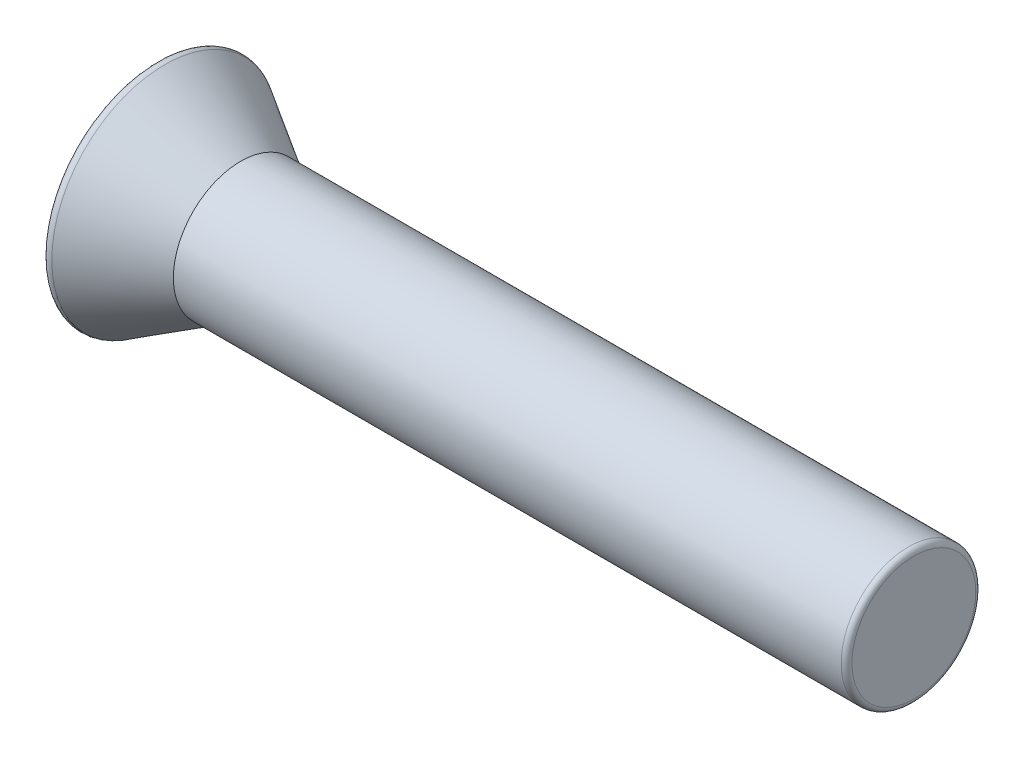
ISO-10303-21;
HEADER;
FILE_DESCRIPTION(('STEP AP214'),'2;1');
FILE_NAME('part.step','',(''),(''),'','','');
FILE_SCHEMA(('AUTOMOTIVE_DESIGN { 1 0 10303 214 1 1 1 1 }'));
ENDSEC;
DATA;
#1=APPLICATION_CONTEXT('core data for automotive mechanical design processes');
#2=APPLICATION_PROTOCOL_DEFINITION('international standard','automotive_design',2000,#1);
#3=PRODUCT_CONTEXT('',#1,'mechanical');
#4=PRODUCT('Part','Part','',(#3));
#5=PRODUCT_RELATED_PRODUCT_CATEGORY('part','',(#4));
#6=PRODUCT_DEFINITION_FORMATION('','',#4);
#7=PRODUCT_DEFINITION_CONTEXT('part definition',#1,'design');
#8=PRODUCT_DEFINITION('design','',#6,#7);
#9=PRODUCT_DEFINITION_SHAPE('','',#8);
#10=(LENGTH_UNIT() NAMED_UNIT(*) SI_UNIT(.MILLI.,.METRE.));
#11=(NAMED_UNIT(*) PLANE_ANGLE_UNIT() SI_UNIT($,.RADIAN.));
#12=(NAMED_UNIT(*) SI_UNIT($,.STERADIAN.) SOLID_ANGLE_UNIT());
#13=UNCERTAINTY_MEASURE_WITH_UNIT(LENGTH_MEASURE(1.E-05),#10,'distance_accuracy_value','');
#14=(GEOMETRIC_REPRESENTATION_CONTEXT(3) GLOBAL_UNCERTAINTY_ASSIGNED_CONTEXT((#13)) GLOBAL_UNIT_ASSIGNED_CONTEXT((#10,
#11,#12)) REPRESENTATION_CONTEXT('',''));
#15=CARTESIAN_POINT('',(0.,0.,0.));
#16=DIRECTION('',(0.,0.,1.));
#17=DIRECTION('',(1.,0.,0.));
#18=AXIS2_PLACEMENT_3D('',#15,#16,#17);
#19=CARTESIAN_POINT('',(2.5,0.,0.));
#20=DIRECTION('',(-1.,0.,0.));
#21=DIRECTION('',(0.,0.,1.));
#22=AXIS2_PLACEMENT_3D('',#19,#20,#21);
#23=CONICAL_SURFACE('',#22,2.,0.540419500270584);
#24=CARTESIAN_POINT('',(0.242319320868404,0.,0.));
#25=DIRECTION('',(1.,0.,0.));
#26=DIRECTION('',(0.,0.,-1.));
#27=AXIS2_PLACEMENT_3D('',#24,#25,#26);
#28=CIRCLE('',#27,3.35460840747896);
#29=CARTESIAN_POINT('',(0.242319320868404,0.,-3.35460840747896));
#30=VERTEX_POINT('',#29);
#31=EDGE_CURVE('E251',#30,#30,#28,.T.);
#32=ORIENTED_EDGE('',*,*,#31,.T.);
#33=EDGE_LOOP('',(#32));
#34=FACE_BOUND('',#33,.T.);
#35=CARTESIAN_POINT('',(2.5,0.,0.));
#36=DIRECTION('',(1.,0.,0.));
#37=DIRECTION('',(0.,0.,-1.));
#38=AXIS2_PLACEMENT_3D('',#35,#36,#37);
#39=CIRCLE('',#38,2.);
#40=CARTESIAN_POINT('',(2.5,0.,-2.));
#41=VERTEX_POINT('',#40);
#42=EDGE_CURVE('E220',#41,#41,#39,.T.);
#43=ORIENTED_EDGE('',*,*,#42,.F.);
#44=EDGE_LOOP('',(#43));
#45=FACE_BOUND('',#44,.T.);
#46=ADVANCED_FACE('F45',(#34,#45),#23,.T.);
#47=CARTESIAN_POINT('',(0.,0.,0.));
#48=DIRECTION('',(-1.,0.,0.));
#49=DIRECTION('',(0.,0.,1.));
#50=AXIS2_PLACEMENT_3D('',#47,#48,#49);
#51=PLANE('',#50);
#52=DIRECTION('',(0.,0.,1.));
#53=VECTOR('',#52,1.);
#54=CARTESIAN_POINT('',(0.,-2.15,-0.41));
#55=LINE('',#54,#53);
#56=CARTESIAN_POINT('',(0.,-2.15,-0.41));
#57=VERTEX_POINT('',#56);
#58=CARTESIAN_POINT('',(0.,-2.15,0.41));
#59=VERTEX_POINT('',#58);
#60=EDGE_CURVE('E61',#57,#59,#55,.T.);
#61=ORIENTED_EDGE('',*,*,#60,.F.);
#62=DIRECTION('',(0.,-1.,0.));
#63=VECTOR('',#62,1.);
#64=CARTESIAN_POINT('',(0.,-0.41,-0.41));
#65=LINE('',#64,#63);
#66=CARTESIAN_POINT('',(0.,-0.41,-0.41));
#67=VERTEX_POINT('',#66);
#68=EDGE_CURVE('E214',#67,#57,#65,.T.);
#69=ORIENTED_EDGE('',*,*,#68,.F.);
#70=DIRECTION('',(0.,0.,1.));
#71=VECTOR('',#70,1.);
#72=CARTESIAN_POINT('',(0.,-0.410000000000001,-2.15));
#73=LINE('',#72,#71);
#74=CARTESIAN_POINT('',(0.,-0.410000000000001,-2.15));
#75=VERTEX_POINT('',#74);
#76=EDGE_CURVE('E211',#75,#67,#73,.T.);
#77=ORIENTED_EDGE('',*,*,#76,.F.);
#78=DIRECTION('',(0.,-1.,0.));
#79=VECTOR('',#78,1.);
#80=CARTESIAN_POINT('',(0.,0.409999999999999,-2.15));
#81=LINE('',#80,#79);
#82=CARTESIAN_POINT('',(0.,0.409999999999999,-2.15));
#83=VERTEX_POINT('',#82);
#84=EDGE_CURVE('E145',#83,#75,#81,.T.);
#85=ORIENTED_EDGE('',*,*,#84,.F.);
#86=DIRECTION('',(0.,0.,-1.));
#87=VECTOR('',#86,1.);
#88=CARTESIAN_POINT('',(0.,0.409999999999999,-2.15));
#89=LINE('',#88,#87);
#90=CARTESIAN_POINT('',(0.,0.409999999999999,-0.41));
#91=VERTEX_POINT('',#90);
#92=EDGE_CURVE('E205',#91,#83,#89,.T.);
#93=ORIENTED_EDGE('',*,*,#92,.F.);
#94=DIRECTION('',(0.,-1.,0.));
#95=VECTOR('',#94,1.);
#96=CARTESIAN_POINT('',(0.,2.15,-0.41));
#97=LINE('',#96,#95);
#98=CARTESIAN_POINT('',(0.,2.15,-0.41));
#99=VERTEX_POINT('',#98);
#100=EDGE_CURVE('E201',#99,#91,#97,.T.);
#101=ORIENTED_EDGE('',*,*,#100,.F.);
#102=DIRECTION('',(0.,0.,-1.));
#103=VECTOR('',#102,1.);
#104=CARTESIAN_POINT('',(0.,2.15,-0.41));
#105=LINE('',#104,#103);
#106=CARTESIAN_POINT('',(0.,2.15,0.41));
#107=VERTEX_POINT('',#106);
#108=EDGE_CURVE('E197',#107,#99,#105,.T.);
#109=ORIENTED_EDGE('',*,*,#108,.F.);
#110=DIRECTION('',(0.,1.,0.));
#111=VECTOR('',#110,1.);
#112=CARTESIAN_POINT('',(0.,2.15,0.41));
#113=LINE('',#112,#111);
#114=CARTESIAN_POINT('',(0.,0.409999999999999,0.41));
#115=VERTEX_POINT('',#114);
#116=EDGE_CURVE('E193',#115,#107,#113,.T.);
#117=ORIENTED_EDGE('',*,*,#116,.F.);
#118=DIRECTION('',(0.,0.,-1.));
#119=VECTOR('',#118,1.);
#120=CARTESIAN_POINT('',(0.,0.409999999999999,0.41));
#121=LINE('',#120,#119);
#122=CARTESIAN_POINT('',(0.,0.409999999999999,2.15));
#123=VERTEX_POINT('',#122);
#124=EDGE_CURVE('E189',#123,#115,#121,.T.);
#125=ORIENTED_EDGE('',*,*,#124,.F.);
#126=DIRECTION('',(0.,1.,0.));
#127=VECTOR('',#126,1.);
#128=CARTESIAN_POINT('',(0.,0.409999999999999,2.15));
#129=LINE('',#128,#127);
#130=CARTESIAN_POINT('',(0.,-0.410000000000001,2.15));
#131=VERTEX_POINT('',#130);
#132=EDGE_CURVE('E185',#131,#123,#129,.T.);
#133=ORIENTED_EDGE('',*,*,#132,.F.);
#134=DIRECTION('',(0.,0.,1.));
#135=VECTOR('',#134,1.);
#136=CARTESIAN_POINT('',(0.,-0.41,0.41));
#137=LINE('',#136,#135);
#138=CARTESIAN_POINT('',(0.,-0.41,0.41));
#139=VERTEX_POINT('',#138);
#140=EDGE_CURVE('E181',#139,#131,#137,.T.);
#141=ORIENTED_EDGE('',*,*,#140,.F.);
#142=DIRECTION('',(0.,1.,0.));
#143=VECTOR('',#142,1.);
#144=CARTESIAN_POINT('',(0.,-0.41,0.41));
#145=LINE('',#144,#143);
#146=EDGE_CURVE('E177',#59,#139,#145,.T.);
#147=ORIENTED_EDGE('',*,*,#146,.F.);
#148=EDGE_LOOP('',(#61,#69,#77,#85,#93,#101,#109,#117,#125,#133,#141,#147));
#149=FACE_BOUND('',#148,.T.);
#150=CARTESIAN_POINT('',(0.,0.,0.));
#151=DIRECTION('',(-1.,0.,0.));
#152=DIRECTION('',(0.,0.,1.));
#153=AXIS2_PLACEMENT_3D('',#150,#151,#152);
#154=CIRCLE('',#153,3.21740953936495);
#155=CARTESIAN_POINT('',(0.,0.,3.21740953936495));
#156=VERTEX_POINT('',#155);
#157=EDGE_CURVE('E255',#156,#156,#154,.T.);
#158=ORIENTED_EDGE('',*,*,#157,.T.);
#159=EDGE_LOOP('',(#158));
#160=FACE_BOUND('',#159,.T.);
#161=ADVANCED_FACE('F278',(#149,#160),#51,.T.);
#162=CARTESIAN_POINT('',(0.16,0.,0.));
#163=DIRECTION('',(-1.,0.,0.));
#164=DIRECTION('',(0.,0.,1.));
#165=AXIS2_PLACEMENT_3D('',#162,#163,#164);
#166=TOROIDAL_SURFACE('',#165,3.21740953936495,0.16);
#167=ORIENTED_EDGE('',*,*,#157,.F.);
#168=EDGE_LOOP('',(#167));
#169=FACE_BOUND('',#168,.T.);
#170=ORIENTED_EDGE('',*,*,#31,.F.);
#171=EDGE_LOOP('',(#170));
#172=FACE_BOUND('',#171,.T.);
#173=ADVANCED_FACE('F284',(#169,#172),#166,.T.);
#174=CARTESIAN_POINT('',(22.5,0.,0.));
#175=DIRECTION('',(-1.,0.,0.));
#176=DIRECTION('',(0.,0.,1.));
#177=AXIS2_PLACEMENT_3D('',#174,#175,#176);
#178=CYLINDRICAL_SURFACE('',#177,2.);
#179=CARTESIAN_POINT('',(22.34,0.,0.));
#180=DIRECTION('',(1.,0.,0.));
#181=DIRECTION('',(0.,0.,-1.));
#182=AXIS2_PLACEMENT_3D('',#179,#180,#181);
#183=CIRCLE('',#182,2.);
#184=CARTESIAN_POINT('',(22.34,0.,-2.));
#185=VERTEX_POINT('',#184);
#186=EDGE_CURVE('E11',#185,#185,#183,.F.);
#187=ORIENTED_EDGE('',*,*,#186,.T.);
#188=EDGE_LOOP('',(#187));
#189=FACE_BOUND('',#188,.T.);
#190=ORIENTED_EDGE('',*,*,#42,.T.);
#191=EDGE_LOOP('',(#190));
#192=FACE_BOUND('',#191,.T.);
#193=ADVANCED_FACE('F274',(#189,#192),#178,.T.);
#194=CARTESIAN_POINT('',(22.5,0.,0.));
#195=DIRECTION('',(1.,0.,0.));
#196=DIRECTION('',(0.,0.,-1.));
#197=AXIS2_PLACEMENT_3D('',#194,#195,#196);
#198=PLANE('',#197);
#199=CARTESIAN_POINT('',(22.5,0.,0.));
#200=DIRECTION('',(1.,0.,0.));
#201=DIRECTION('',(0.,0.,-1.));
#202=AXIS2_PLACEMENT_3D('',#199,#200,#201);
#203=CIRCLE('',#202,1.84);
#204=CARTESIAN_POINT('',(22.5,0.,-1.84));
#205=VERTEX_POINT('',#204);
#206=EDGE_CURVE('E54',#205,#205,#203,.T.);
#207=ORIENTED_EDGE('',*,*,#206,.T.);
#208=EDGE_LOOP('',(#207));
#209=FACE_BOUND('',#208,.T.);
#210=ADVANCED_FACE('F262',(#209),#198,.T.);
#211=CARTESIAN_POINT('',(22.34,0.,0.));
#212=DIRECTION('',(1.,0.,0.));
#213=DIRECTION('',(0.,0.,-1.));
#214=AXIS2_PLACEMENT_3D('',#211,#212,#213);
#215=TOROIDAL_SURFACE('',#214,1.84,0.16);
#216=ORIENTED_EDGE('',*,*,#186,.F.);
#217=EDGE_LOOP('',(#216));
#218=FACE_BOUND('',#217,.T.);
#219=ORIENTED_EDGE('',*,*,#206,.F.);
#220=EDGE_LOOP('',(#219));
#221=FACE_BOUND('',#220,.T.);
#222=ADVANCED_FACE('F47',(#218,#221),#215,.T.);
#223=CARTESIAN_POINT('',(0.999999999999997,-2.15,-0.41));
#224=DIRECTION('',(0.,-1.,0.));
#225=DIRECTION('',(0.,0.,-1.));
#226=AXIS2_PLACEMENT_3D('',#223,#224,#225);
#227=PLANE('',#226);
#228=ORIENTED_EDGE('',*,*,#60,.T.);
#229=DIRECTION('',(-1.,0.,0.));
#230=VECTOR('',#229,1.);
#231=CARTESIAN_POINT('',(0.999999999999997,-2.15,0.41));
#232=LINE('',#231,#230);
#233=CARTESIAN_POINT('',(0.999999999999997,-2.15,0.41));
#234=VERTEX_POINT('',#233);
#235=EDGE_CURVE('E109',#234,#59,#232,.T.);
#236=ORIENTED_EDGE('',*,*,#235,.F.);
#237=DIRECTION('',(0.,0.,1.));
#238=VECTOR('',#237,1.);
#239=CARTESIAN_POINT('',(0.999999999999997,-2.15,-0.41));
#240=LINE('',#239,#238);
#241=CARTESIAN_POINT('',(0.999999999999997,-2.15,-0.41));
#242=VERTEX_POINT('',#241);
#243=EDGE_CURVE('E217',#242,#234,#240,.T.);
#244=ORIENTED_EDGE('',*,*,#243,.F.);
#245=DIRECTION('',(-1.,0.,0.));
#246=VECTOR('',#245,1.);
#247=CARTESIAN_POINT('',(0.999999999999997,-2.15,-0.41));
#248=LINE('',#247,#246);
#249=EDGE_CURVE('E69',#242,#57,#248,.T.);
#250=ORIENTED_EDGE('',*,*,#249,.T.);
#251=EDGE_LOOP('',(#228,#236,#244,#250));
#252=FACE_BOUND('',#251,.T.);
#253=ADVANCED_FACE('F265',(#252),#227,.F.);
#254=CARTESIAN_POINT('',(0.999999999999997,-0.41,-0.41));
#255=DIRECTION('',(0.,0.,-1.));
#256=DIRECTION('',(0.,1.,0.));
#257=AXIS2_PLACEMENT_3D('',#254,#255,#256);
#258=PLANE('',#257);
#259=ORIENTED_EDGE('',*,*,#68,.T.);
#260=ORIENTED_EDGE('',*,*,#249,.F.);
#261=DIRECTION('',(0.,-1.,0.));
#262=VECTOR('',#261,1.);
#263=CARTESIAN_POINT('',(0.999999999999997,-0.41,-0.41));
#264=LINE('',#263,#262);
#265=CARTESIAN_POINT('',(0.999999999999997,-0.41,-0.41));
#266=VERTEX_POINT('',#265);
#267=EDGE_CURVE('E159',#266,#242,#264,.T.);
#268=ORIENTED_EDGE('',*,*,#267,.F.);
#269=DIRECTION('',(-1.,0.,0.));
#270=VECTOR('',#269,1.);
#271=CARTESIAN_POINT('',(0.999999999999997,-0.41,-0.41));
#272=LINE('',#271,#270);
#273=EDGE_CURVE('E150',#266,#67,#272,.T.);
#274=ORIENTED_EDGE('',*,*,#273,.T.);
#275=EDGE_LOOP('',(#259,#260,#268,#274));
#276=FACE_BOUND('',#275,.T.);
#277=ADVANCED_FACE('F272',(#276),#258,.F.);
#278=CARTESIAN_POINT('',(0.999999999999997,-0.410000000000001,-2.15));
#279=DIRECTION('',(0.,-1.,0.));
#280=DIRECTION('',(0.,0.,-1.));
#281=AXIS2_PLACEMENT_3D('',#278,#279,#280);
#282=PLANE('',#281);
#283=ORIENTED_EDGE('',*,*,#76,.T.);
#284=ORIENTED_EDGE('',*,*,#273,.F.);
#285=DIRECTION('',(0.,0.,1.));
#286=VECTOR('',#285,1.);
#287=CARTESIAN_POINT('',(0.999999999999997,-0.410000000000001,-2.15));
#288=LINE('',#287,#286);
#289=CARTESIAN_POINT('',(0.999999999999997,-0.410000000000001,-2.15));
#290=VERTEX_POINT('',#289);
#291=EDGE_CURVE('E154',#290,#266,#288,.T.);
#292=ORIENTED_EDGE('',*,*,#291,.F.);
#293=DIRECTION('',(-1.,0.,0.));
#294=VECTOR('',#293,1.);
#295=CARTESIAN_POINT('',(0.999999999999997,-0.410000000000001,-2.15));
#296=LINE('',#295,#294);
#297=EDGE_CURVE('E138',#290,#75,#296,.T.);
#298=ORIENTED_EDGE('',*,*,#297,.T.);
#299=EDGE_LOOP('',(#283,#284,#292,#298));
#300=FACE_BOUND('',#299,.T.);
#301=ADVANCED_FACE('F155',(#300),#282,.F.);
#302=CARTESIAN_POINT('',(0.999999999999997,0.409999999999999,-2.15));
#303=DIRECTION('',(0.,0.,-1.));
#304=DIRECTION('',(-1.,0.,0.));
#305=AXIS2_PLACEMENT_3D('',#302,#303,#304);
#306=PLANE('',#305);
#307=ORIENTED_EDGE('',*,*,#84,.T.);
#308=ORIENTED_EDGE('',*,*,#297,.F.);
#309=DIRECTION('',(0.,-1.,0.));
#310=VECTOR('',#309,1.);
#311=CARTESIAN_POINT('',(0.999999999999997,0.409999999999999,-2.15));
#312=LINE('',#311,#310);
#313=CARTESIAN_POINT('',(0.999999999999997,0.409999999999999,-2.15));
#314=VERTEX_POINT('',#313);
#315=EDGE_CURVE('E142',#314,#290,#312,.T.);
#316=ORIENTED_EDGE('',*,*,#315,.F.);
#317=DIRECTION('',(-1.,0.,0.));
#318=VECTOR('',#317,1.);
#319=CARTESIAN_POINT('',(0.999999999999997,0.409999999999999,-2.15));
#320=LINE('',#319,#318);
#321=EDGE_CURVE('E151',#314,#83,#320,.T.);
#322=ORIENTED_EDGE('',*,*,#321,.T.);
#323=EDGE_LOOP('',(#307,#308,#316,#322));
#324=FACE_BOUND('',#323,.T.);
#325=ADVANCED_FACE('F140',(#324),#306,.F.);
#326=CARTESIAN_POINT('',(0.999999999999997,0.409999999999999,-2.15));
#327=DIRECTION('',(0.,1.,0.));
#328=DIRECTION('',(0.,0.,1.));
#329=AXIS2_PLACEMENT_3D('',#326,#327,#328);
#330=PLANE('',#329);
#331=ORIENTED_EDGE('',*,*,#92,.T.);
#332=ORIENTED_EDGE('',*,*,#321,.F.);
#333=DIRECTION('',(0.,0.,-1.));
#334=VECTOR('',#333,1.);
#335=CARTESIAN_POINT('',(0.999999999999997,0.409999999999999,-2.15));
#336=LINE('',#335,#334);
#337=CARTESIAN_POINT('',(0.999999999999997,0.409999999999999,-0.41));
#338=VERTEX_POINT('',#337);
#339=EDGE_CURVE('E165',#338,#314,#336,.T.);
#340=ORIENTED_EDGE('',*,*,#339,.F.);
#341=DIRECTION('',(-1.,0.,0.));
#342=VECTOR('',#341,1.);
#343=CARTESIAN_POINT('',(0.999999999999997,0.409999999999999,-0.41));
#344=LINE('',#343,#342);
#345=EDGE_CURVE('E225',#338,#91,#344,.T.);
#346=ORIENTED_EDGE('',*,*,#345,.T.);
#347=EDGE_LOOP('',(#331,#332,#340,#346));
#348=FACE_BOUND('',#347,.T.);
#349=ADVANCED_FACE('F329',(#348),#330,.F.);
#350=CARTESIAN_POINT('',(0.999999999999997,2.15,-0.41));
#351=DIRECTION('',(0.,0.,-1.));
#352=DIRECTION('',(0.,1.,0.));
#353=AXIS2_PLACEMENT_3D('',#350,#351,#352);
#354=PLANE('',#353);
#355=ORIENTED_EDGE('',*,*,#100,.T.);
#356=ORIENTED_EDGE('',*,*,#345,.F.);
#357=DIRECTION('',(0.,-1.,0.));
#358=VECTOR('',#357,1.);
#359=CARTESIAN_POINT('',(0.999999999999997,2.15,-0.41));
#360=LINE('',#359,#358);
#361=CARTESIAN_POINT('',(0.999999999999997,2.15,-0.41));
#362=VERTEX_POINT('',#361);
#363=EDGE_CURVE('E169',#362,#338,#360,.T.);
#364=ORIENTED_EDGE('',*,*,#363,.F.);
#365=DIRECTION('',(-1.,0.,0.));
#366=VECTOR('',#365,1.);
#367=CARTESIAN_POINT('',(0.999999999999997,2.15,-0.41));
#368=LINE('',#367,#366);
#369=EDGE_CURVE('E228',#362,#99,#368,.T.);
#370=ORIENTED_EDGE('',*,*,#369,.T.);
#371=EDGE_LOOP('',(#355,#356,#364,#370));
#372=FACE_BOUND('',#371,.T.);
#373=ADVANCED_FACE('F325',(#372),#354,.F.);
#374=CARTESIAN_POINT('',(0.999999999999997,2.15,-0.41));
#375=DIRECTION('',(0.,1.,0.));
#376=DIRECTION('',(0.,0.,1.));
#377=AXIS2_PLACEMENT_3D('',#374,#375,#376);
#378=PLANE('',#377);
#379=ORIENTED_EDGE('',*,*,#108,.T.);
#380=ORIENTED_EDGE('',*,*,#369,.F.);
#381=DIRECTION('',(0.,0.,-1.));
#382=VECTOR('',#381,1.);
#383=CARTESIAN_POINT('',(0.999999999999997,2.15,-0.41));
#384=LINE('',#383,#382);
#385=CARTESIAN_POINT('',(0.999999999999997,2.15,0.41));
#386=VERTEX_POINT('',#385);
#387=EDGE_CURVE('E475',#386,#362,#384,.T.);
#388=ORIENTED_EDGE('',*,*,#387,.F.);
#389=DIRECTION('',(-1.,0.,0.));
#390=VECTOR('',#389,1.);
#391=CARTESIAN_POINT('',(0.999999999999997,2.15,0.41));
#392=LINE('',#391,#390);
#393=EDGE_CURVE('E231',#386,#107,#392,.T.);
#394=ORIENTED_EDGE('',*,*,#393,.T.);
#395=EDGE_LOOP('',(#379,#380,#388,#394));
#396=FACE_BOUND('',#395,.T.);
#397=ADVANCED_FACE('F321',(#396),#378,.F.);
#398=CARTESIAN_POINT('',(0.999999999999997,2.15,0.41));
#399=DIRECTION('',(0.,0.,1.));
#400=DIRECTION('',(0.,-1.,0.));
#401=AXIS2_PLACEMENT_3D('',#398,#399,#400);
#402=PLANE('',#401);
#403=ORIENTED_EDGE('',*,*,#116,.T.);
#404=ORIENTED_EDGE('',*,*,#393,.F.);
#405=DIRECTION('',(0.,1.,0.));
#406=VECTOR('',#405,1.);
#407=CARTESIAN_POINT('',(0.999999999999997,2.15,0.41));
#408=LINE('',#407,#406);
#409=CARTESIAN_POINT('',(0.999999999999997,0.409999999999999,0.41));
#410=VERTEX_POINT('',#409);
#411=EDGE_CURVE('E471',#410,#386,#408,.T.);
#412=ORIENTED_EDGE('',*,*,#411,.F.);
#413=DIRECTION('',(-1.,0.,0.));
#414=VECTOR('',#413,1.);
#415=CARTESIAN_POINT('',(0.999999999999997,0.409999999999999,0.41));
#416=LINE('',#415,#414);
#417=EDGE_CURVE('E234',#410,#115,#416,.T.);
#418=ORIENTED_EDGE('',*,*,#417,.T.);
#419=EDGE_LOOP('',(#403,#404,#412,#418));
#420=FACE_BOUND('',#419,.T.);
#421=ADVANCED_FACE('F317',(#420),#402,.F.);
#422=CARTESIAN_POINT('',(0.999999999999997,0.409999999999999,0.41));
#423=DIRECTION('',(0.,1.,0.));
#424=DIRECTION('',(0.,0.,1.));
#425=AXIS2_PLACEMENT_3D('',#422,#423,#424);
#426=PLANE('',#425);
#427=ORIENTED_EDGE('',*,*,#124,.T.);
#428=ORIENTED_EDGE('',*,*,#417,.F.);
#429=DIRECTION('',(0.,0.,-1.));
#430=VECTOR('',#429,1.);
#431=CARTESIAN_POINT('',(0.999999999999997,0.409999999999999,0.41));
#432=LINE('',#431,#430);
#433=CARTESIAN_POINT('',(0.999999999999997,0.409999999999999,2.15));
#434=VERTEX_POINT('',#433);
#435=EDGE_CURVE('E467',#434,#410,#432,.T.);
#436=ORIENTED_EDGE('',*,*,#435,.F.);
#437=DIRECTION('',(-1.,0.,0.));
#438=VECTOR('',#437,1.);
#439=CARTESIAN_POINT('',(0.999999999999997,0.409999999999999,2.15));
#440=LINE('',#439,#438);
#441=EDGE_CURVE('E237',#434,#123,#440,.T.);
#442=ORIENTED_EDGE('',*,*,#441,.T.);
#443=EDGE_LOOP('',(#427,#428,#436,#442));
#444=FACE_BOUND('',#443,.T.);
#445=ADVANCED_FACE('F313',(#444),#426,.F.);
#446=CARTESIAN_POINT('',(0.999999999999997,0.409999999999999,2.15));
#447=DIRECTION('',(0.,0.,1.));
#448=DIRECTION('',(1.,0.,0.));
#449=AXIS2_PLACEMENT_3D('',#446,#447,#448);
#450=PLANE('',#449);
#451=ORIENTED_EDGE('',*,*,#132,.T.);
#452=ORIENTED_EDGE('',*,*,#441,.F.);
#453=DIRECTION('',(0.,1.,0.));
#454=VECTOR('',#453,1.);
#455=CARTESIAN_POINT('',(0.999999999999997,0.409999999999999,2.15));
#456=LINE('',#455,#454);
#457=CARTESIAN_POINT('',(0.999999999999997,-0.410000000000001,2.15));
#458=VERTEX_POINT('',#457);
#459=EDGE_CURVE('E463',#458,#434,#456,.T.);
#460=ORIENTED_EDGE('',*,*,#459,.F.);
#461=DIRECTION('',(-1.,0.,0.));
#462=VECTOR('',#461,1.);
#463=CARTESIAN_POINT('',(0.999999999999997,-0.410000000000001,2.15));
#464=LINE('',#463,#462);
#465=EDGE_CURVE('E240',#458,#131,#464,.T.);
#466=ORIENTED_EDGE('',*,*,#465,.T.);
#467=EDGE_LOOP('',(#451,#452,#460,#466));
#468=FACE_BOUND('',#467,.T.);
#469=ADVANCED_FACE('F309',(#468),#450,.F.);
#470=CARTESIAN_POINT('',(0.999999999999997,-0.41,0.41));
#471=DIRECTION('',(0.,-1.,0.));
#472=DIRECTION('',(0.,0.,-1.));
#473=AXIS2_PLACEMENT_3D('',#470,#471,#472);
#474=PLANE('',#473);
#475=ORIENTED_EDGE('',*,*,#140,.T.);
#476=ORIENTED_EDGE('',*,*,#465,.F.);
#477=DIRECTION('',(0.,0.,1.));
#478=VECTOR('',#477,1.);
#479=CARTESIAN_POINT('',(0.999999999999997,-0.41,0.41));
#480=LINE('',#479,#478);
#481=CARTESIAN_POINT('',(0.999999999999997,-0.41,0.41));
#482=VERTEX_POINT('',#481);
#483=EDGE_CURVE('E456',#482,#458,#480,.T.);
#484=ORIENTED_EDGE('',*,*,#483,.F.);
#485=DIRECTION('',(-1.,0.,0.));
#486=VECTOR('',#485,1.);
#487=CARTESIAN_POINT('',(0.999999999999997,-0.41,0.41));
#488=LINE('',#487,#486);
#489=EDGE_CURVE('E243',#482,#139,#488,.T.);
#490=ORIENTED_EDGE('',*,*,#489,.T.);
#491=EDGE_LOOP('',(#475,#476,#484,#490));
#492=FACE_BOUND('',#491,.T.);
#493=ADVANCED_FACE('F305',(#492),#474,.F.);
#494=CARTESIAN_POINT('',(0.999999999999997,-0.41,0.41));
#495=DIRECTION('',(0.,0.,1.));
#496=DIRECTION('',(0.,-1.,0.));
#497=AXIS2_PLACEMENT_3D('',#494,#495,#496);
#498=PLANE('',#497);
#499=ORIENTED_EDGE('',*,*,#146,.T.);
#500=ORIENTED_EDGE('',*,*,#489,.F.);
#501=DIRECTION('',(0.,1.,0.));
#502=VECTOR('',#501,1.);
#503=CARTESIAN_POINT('',(0.999999999999997,-0.41,0.41));
#504=LINE('',#503,#502);
#505=EDGE_CURVE('E453',#234,#482,#504,.T.);
#506=ORIENTED_EDGE('',*,*,#505,.F.);
#507=ORIENTED_EDGE('',*,*,#235,.T.);
#508=EDGE_LOOP('',(#499,#500,#506,#507));
#509=FACE_BOUND('',#508,.T.);
#510=ADVANCED_FACE('F302',(#509),#498,.F.);
#511=CARTESIAN_POINT('',(0.999999999999997,0.,0.));
#512=DIRECTION('',(1.,0.,0.));
#513=DIRECTION('',(0.,0.,-1.));
#514=AXIS2_PLACEMENT_3D('',#511,#512,#513);
#515=PLANE('',#514);
#516=ORIENTED_EDGE('',*,*,#243,.T.);
#517=ORIENTED_EDGE('',*,*,#505,.T.);
#518=ORIENTED_EDGE('',*,*,#483,.T.);
#519=ORIENTED_EDGE('',*,*,#459,.T.);
#520=ORIENTED_EDGE('',*,*,#435,.T.);
#521=ORIENTED_EDGE('',*,*,#411,.T.);
#522=ORIENTED_EDGE('',*,*,#387,.T.);
#523=ORIENTED_EDGE('',*,*,#363,.T.);
#524=ORIENTED_EDGE('',*,*,#339,.T.);
#525=ORIENTED_EDGE('',*,*,#315,.T.);
#526=ORIENTED_EDGE('',*,*,#291,.T.);
#527=ORIENTED_EDGE('',*,*,#267,.T.);
#528=EDGE_LOOP('',(#516,#517,#518,#519,#520,#521,#522,#523,#524,#525,#526,#527));
#529=FACE_BOUND('',#528,.T.);
#530=ADVANCED_FACE('F162',(#529),#515,.F.);
#531=CLOSED_SHELL('',(#46,#161,#173,#193,#210,#222,#253,#277,#301,#325,#349,#373,#397,#421,#445,
#469,#493,#510,#530));
#532=MANIFOLD_SOLID_BREP('B2',#531);
#533=ADVANCED_BREP_SHAPE_REPRESENTATION('',(#18,#532),#14);
#534=SHAPE_DEFINITION_REPRESENTATION(#9,#533);
ENDSEC;
END-ISO-10303-21;
